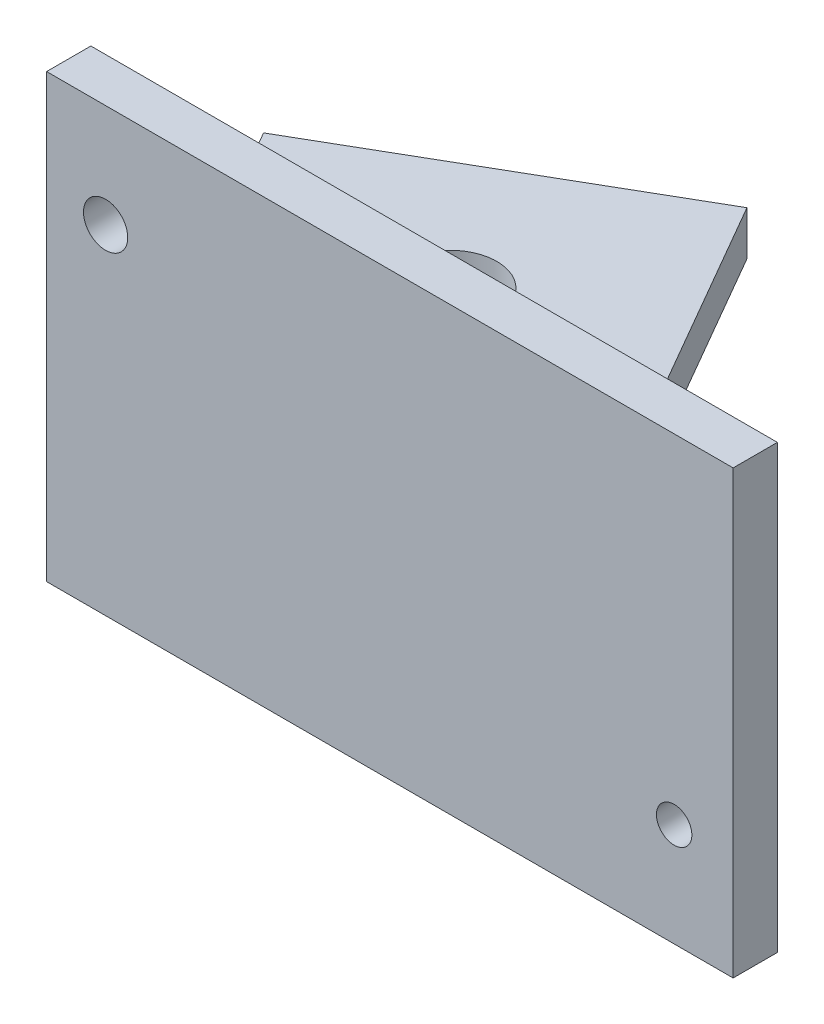
ISO-10303-21;
HEADER;
FILE_DESCRIPTION(('STEP AP214'),'2;1');
FILE_NAME('part.step','',(''),(''),'','','');
FILE_SCHEMA(('AUTOMOTIVE_DESIGN { 1 0 10303 214 1 1 1 1 }'));
ENDSEC;
DATA;
#1=APPLICATION_CONTEXT('core data for automotive mechanical design processes');
#2=APPLICATION_PROTOCOL_DEFINITION('international standard','automotive_design',2000,#1);
#3=PRODUCT_CONTEXT('',#1,'mechanical');
#4=PRODUCT('Part','Part','',(#3));
#5=PRODUCT_RELATED_PRODUCT_CATEGORY('part','',(#4));
#6=PRODUCT_DEFINITION_FORMATION('','',#4);
#7=PRODUCT_DEFINITION_CONTEXT('part definition',#1,'design');
#8=PRODUCT_DEFINITION('design','',#6,#7);
#9=PRODUCT_DEFINITION_SHAPE('','',#8);
#10=(LENGTH_UNIT() NAMED_UNIT(*) SI_UNIT(.MILLI.,.METRE.));
#11=(NAMED_UNIT(*) PLANE_ANGLE_UNIT() SI_UNIT($,.RADIAN.));
#12=(NAMED_UNIT(*) SI_UNIT($,.STERADIAN.) SOLID_ANGLE_UNIT());
#13=UNCERTAINTY_MEASURE_WITH_UNIT(LENGTH_MEASURE(1.E-05),#10,'distance_accuracy_value','');
#14=(GEOMETRIC_REPRESENTATION_CONTEXT(3) GLOBAL_UNCERTAINTY_ASSIGNED_CONTEXT((#13)) GLOBAL_UNIT_ASSIGNED_CONTEXT((#10,
#11,#12)) REPRESENTATION_CONTEXT('',''));
#15=CARTESIAN_POINT('',(0.,0.,0.));
#16=DIRECTION('',(0.,0.,1.));
#17=DIRECTION('',(1.,0.,0.));
#18=AXIS2_PLACEMENT_3D('',#15,#16,#17);
#19=CARTESIAN_POINT('',(0.,0.,2.38125));
#20=DIRECTION('',(0.,0.,-1.));
#21=DIRECTION('',(-1.,0.,0.));
#22=AXIS2_PLACEMENT_3D('',#19,#20,#21);
#23=PLANE('',#22);
#24=DIRECTION('',(0.,-1.,0.));
#25=VECTOR('',#24,1.);
#26=CARTESIAN_POINT('',(-1.5875,-1.5875,2.38125));
#27=LINE('',#26,#25);
#28=CARTESIAN_POINT('',(-1.5875,19.812,2.38125));
#29=VERTEX_POINT('',#28);
#30=CARTESIAN_POINT('',(-1.5875,-3.96875,2.38125));
#31=VERTEX_POINT('',#30);
#32=EDGE_CURVE('E157',#29,#31,#27,.T.);
#33=ORIENTED_EDGE('',*,*,#32,.T.);
#34=DIRECTION('',(-1.,0.,0.));
#35=VECTOR('',#34,1.);
#36=CARTESIAN_POINT('',(-1.5875,-3.96875,2.38125));
#37=LINE('',#36,#35);
#38=CARTESIAN_POINT('',(35.3695,-3.96875,2.38125));
#39=VERTEX_POINT('',#38);
#40=EDGE_CURVE('E121',#39,#31,#37,.T.);
#41=ORIENTED_EDGE('',*,*,#40,.F.);
#42=DIRECTION('',(0.,1.,0.));
#43=VECTOR('',#42,1.);
#44=CARTESIAN_POINT('',(35.3695,-1.5875,2.38125));
#45=LINE('',#44,#43);
#46=CARTESIAN_POINT('',(35.3695,19.812,2.38125));
#47=VERTEX_POINT('',#46);
#48=EDGE_CURVE('E160',#39,#47,#45,.T.);
#49=ORIENTED_EDGE('',*,*,#48,.T.);
#50=DIRECTION('',(-1.,0.,0.));
#51=VECTOR('',#50,1.);
#52=CARTESIAN_POINT('',(-1.5875,19.812,2.38125));
#53=LINE('',#52,#51);
#54=EDGE_CURVE('E164',#47,#29,#53,.T.);
#55=ORIENTED_EDGE('',*,*,#54,.T.);
#56=EDGE_LOOP('',(#33,#41,#49,#55));
#57=FACE_BOUND('',#56,.T.);
#58=CARTESIAN_POINT('',(1.5875,14.25575,2.38125));
#59=DIRECTION('',(0.,0.,1.));
#60=DIRECTION('',(1.,0.,0.));
#61=AXIS2_PLACEMENT_3D('',#58,#59,#60);
#62=CIRCLE('',#61,1.190625);
#63=CARTESIAN_POINT('',(2.778125,14.25575,2.38125));
#64=VERTEX_POINT('',#63);
#65=EDGE_CURVE('E151',#64,#64,#62,.T.);
#66=ORIENTED_EDGE('',*,*,#65,.F.);
#67=EDGE_LOOP('',(#66));
#68=FACE_BOUND('',#67,.T.);
#69=CARTESIAN_POINT('',(32.1945,1.5875,2.38125));
#70=DIRECTION('',(0.,0.,1.));
#71=DIRECTION('',(1.,0.,0.));
#72=AXIS2_PLACEMENT_3D('',#69,#70,#71);
#73=CIRCLE('',#72,0.952500000000004);
#74=CARTESIAN_POINT('',(33.147,1.5875,2.38125));
#75=VERTEX_POINT('',#74);
#76=EDGE_CURVE('E140',#75,#75,#73,.T.);
#77=ORIENTED_EDGE('',*,*,#76,.F.);
#78=EDGE_LOOP('',(#77));
#79=FACE_BOUND('',#78,.T.);
#80=ADVANCED_FACE('F39',(#57,#68,#79),#23,.F.);
#81=CARTESIAN_POINT('',(0.,0.,0.));
#82=DIRECTION('',(0.,0.,-1.));
#83=DIRECTION('',(-1.,0.,0.));
#84=AXIS2_PLACEMENT_3D('',#81,#82,#83);
#85=PLANE('',#84);
#86=CARTESIAN_POINT('',(1.5875,14.25575,0.));
#87=DIRECTION('',(0.,0.,1.));
#88=DIRECTION('',(1.,0.,0.));
#89=AXIS2_PLACEMENT_3D('',#86,#87,#88);
#90=CIRCLE('',#89,1.190625);
#91=CARTESIAN_POINT('',(2.778125,14.25575,0.));
#92=VERTEX_POINT('',#91);
#93=EDGE_CURVE('E149',#92,#92,#90,.T.);
#94=ORIENTED_EDGE('',*,*,#93,.T.);
#95=EDGE_LOOP('',(#94));
#96=FACE_BOUND('',#95,.T.);
#97=DIRECTION('',(0.,1.,0.));
#98=VECTOR('',#97,1.);
#99=CARTESIAN_POINT('',(20.4095452561247,-3.96875,0.));
#100=LINE('',#99,#98);
#101=CARTESIAN_POINT('',(20.4095452561247,-3.96875,0.));
#102=VERTEX_POINT('',#101);
#103=CARTESIAN_POINT('',(20.4095452561247,0.9525,0.));
#104=VERTEX_POINT('',#103);
#105=EDGE_CURVE('E54',#102,#104,#100,.T.);
#106=ORIENTED_EDGE('',*,*,#105,.T.);
#107=DIRECTION('',(1.,0.,0.));
#108=VECTOR('',#107,1.);
#109=CARTESIAN_POINT('',(0.,0.9525,0.));
#110=LINE('',#109,#108);
#111=CARTESIAN_POINT('',(-1.5875,0.952499999999997,0.));
#112=VERTEX_POINT('',#111);
#113=EDGE_CURVE('E183',#104,#112,#110,.F.);
#114=ORIENTED_EDGE('',*,*,#113,.T.);
#115=DIRECTION('',(0.,-1.,0.));
#116=VECTOR('',#115,1.);
#117=CARTESIAN_POINT('',(-1.5875,-1.5875,0.));
#118=LINE('',#117,#116);
#119=CARTESIAN_POINT('',(-1.5875,19.812,0.));
#120=VERTEX_POINT('',#119);
#121=EDGE_CURVE('E131',#120,#112,#118,.T.);
#122=ORIENTED_EDGE('',*,*,#121,.F.);
#123=DIRECTION('',(-1.,0.,0.));
#124=VECTOR('',#123,1.);
#125=CARTESIAN_POINT('',(-1.5875,19.812,0.));
#126=LINE('',#125,#124);
#127=CARTESIAN_POINT('',(35.3695,19.812,0.));
#128=VERTEX_POINT('',#127);
#129=EDGE_CURVE('E161',#128,#120,#126,.T.);
#130=ORIENTED_EDGE('',*,*,#129,.F.);
#131=DIRECTION('',(0.,1.,0.));
#132=VECTOR('',#131,1.);
#133=CARTESIAN_POINT('',(35.3695,-1.5875,0.));
#134=LINE('',#133,#132);
#135=CARTESIAN_POINT('',(35.3695,-3.96875,0.));
#136=VERTEX_POINT('',#135);
#137=EDGE_CURVE('E170',#136,#128,#134,.T.);
#138=ORIENTED_EDGE('',*,*,#137,.F.);
#139=DIRECTION('',(1.,0.,0.));
#140=VECTOR('',#139,1.);
#141=CARTESIAN_POINT('',(20.4095452561247,-3.96875,0.));
#142=LINE('',#141,#140);
#143=EDGE_CURVE('E209',#102,#136,#142,.T.);
#144=ORIENTED_EDGE('',*,*,#143,.F.);
#145=EDGE_LOOP('',(#106,#114,#122,#130,#138,#144));
#146=FACE_BOUND('',#145,.T.);
#147=CARTESIAN_POINT('',(32.1945,1.5875,0.));
#148=DIRECTION('',(0.,0.,1.));
#149=DIRECTION('',(1.,0.,0.));
#150=AXIS2_PLACEMENT_3D('',#147,#148,#149);
#151=CIRCLE('',#150,0.952500000000004);
#152=CARTESIAN_POINT('',(33.147,1.5875,0.));
#153=VERTEX_POINT('',#152);
#154=EDGE_CURVE('E134',#153,#153,#151,.T.);
#155=ORIENTED_EDGE('',*,*,#154,.T.);
#156=EDGE_LOOP('',(#155));
#157=FACE_BOUND('',#156,.T.);
#158=ADVANCED_FACE('F193',(#96,#146,#157),#85,.T.);
#159=CARTESIAN_POINT('',(-1.5875,-1.5875,2.38125));
#160=DIRECTION('',(1.,0.,0.));
#161=DIRECTION('',(0.,0.,-1.));
#162=AXIS2_PLACEMENT_3D('',#159,#160,#161);
#163=PLANE('',#162);
#164=ORIENTED_EDGE('',*,*,#121,.T.);
#165=DIRECTION('',(0.,1.,0.));
#166=VECTOR('',#165,1.);
#167=CARTESIAN_POINT('',(-1.5875,-3.96875,0.));
#168=LINE('',#167,#166);
#169=CARTESIAN_POINT('',(-1.5875,-3.96875,0.));
#170=VERTEX_POINT('',#169);
#171=EDGE_CURVE('E107',#170,#112,#168,.T.);
#172=ORIENTED_EDGE('',*,*,#171,.F.);
#173=DIRECTION('',(0.,0.,-1.));
#174=VECTOR('',#173,1.);
#175=CARTESIAN_POINT('',(-1.5875,-3.96875,2.38125));
#176=LINE('',#175,#174);
#177=EDGE_CURVE('E114',#31,#170,#176,.T.);
#178=ORIENTED_EDGE('',*,*,#177,.F.);
#179=ORIENTED_EDGE('',*,*,#32,.F.);
#180=DIRECTION('',(0.,0.,-1.));
#181=VECTOR('',#180,1.);
#182=CARTESIAN_POINT('',(-1.5875,19.812,2.38125));
#183=LINE('',#182,#181);
#184=EDGE_CURVE('E167',#29,#120,#183,.T.);
#185=ORIENTED_EDGE('',*,*,#184,.T.);
#186=EDGE_LOOP('',(#164,#172,#178,#179,#185));
#187=FACE_BOUND('',#186,.T.);
#188=ADVANCED_FACE('F128',(#187),#163,.F.);
#189=CARTESIAN_POINT('',(35.3695,-1.5875,2.38125));
#190=DIRECTION('',(-1.,0.,0.));
#191=DIRECTION('',(0.,0.,1.));
#192=AXIS2_PLACEMENT_3D('',#189,#190,#191);
#193=PLANE('',#192);
#194=ORIENTED_EDGE('',*,*,#137,.T.);
#195=DIRECTION('',(0.,0.,-1.));
#196=VECTOR('',#195,1.);
#197=CARTESIAN_POINT('',(35.3695,19.812,2.38125));
#198=LINE('',#197,#196);
#199=EDGE_CURVE('E176',#47,#128,#198,.T.);
#200=ORIENTED_EDGE('',*,*,#199,.F.);
#201=ORIENTED_EDGE('',*,*,#48,.F.);
#202=DIRECTION('',(0.,0.,1.));
#203=VECTOR('',#202,1.);
#204=CARTESIAN_POINT('',(35.3695,-3.96875,2.38125));
#205=LINE('',#204,#203);
#206=EDGE_CURVE('E207',#136,#39,#205,.T.);
#207=ORIENTED_EDGE('',*,*,#206,.F.);
#208=EDGE_LOOP('',(#194,#200,#201,#207));
#209=FACE_BOUND('',#208,.T.);
#210=ADVANCED_FACE('F206',(#209),#193,.F.);
#211=CARTESIAN_POINT('',(-1.5875,19.812,2.38125));
#212=DIRECTION('',(0.,-1.,0.));
#213=DIRECTION('',(0.,0.,-1.));
#214=AXIS2_PLACEMENT_3D('',#211,#212,#213);
#215=PLANE('',#214);
#216=ORIENTED_EDGE('',*,*,#129,.T.);
#217=ORIENTED_EDGE('',*,*,#184,.F.);
#218=ORIENTED_EDGE('',*,*,#54,.F.);
#219=ORIENTED_EDGE('',*,*,#199,.T.);
#220=EDGE_LOOP('',(#216,#217,#218,#219));
#221=FACE_BOUND('',#220,.T.);
#222=ADVANCED_FACE('F199',(#221),#215,.F.);
#223=CARTESIAN_POINT('',(1.5875,14.25575,2.38125));
#224=DIRECTION('',(0.,0.,-1.));
#225=DIRECTION('',(-1.,0.,0.));
#226=AXIS2_PLACEMENT_3D('',#223,#224,#225);
#227=CYLINDRICAL_SURFACE('',#226,1.190625);
#228=ORIENTED_EDGE('',*,*,#65,.T.);
#229=EDGE_LOOP('',(#228));
#230=FACE_BOUND('',#229,.T.);
#231=ORIENTED_EDGE('',*,*,#93,.F.);
#232=EDGE_LOOP('',(#231));
#233=FACE_BOUND('',#232,.T.);
#234=ADVANCED_FACE('F286',(#230,#233),#227,.F.);
#235=CARTESIAN_POINT('',(32.1945,1.5875,2.38125));
#236=DIRECTION('',(0.,0.,-1.));
#237=DIRECTION('',(-1.,0.,0.));
#238=AXIS2_PLACEMENT_3D('',#235,#236,#237);
#239=CYLINDRICAL_SURFACE('',#238,0.952500000000004);
#240=ORIENTED_EDGE('',*,*,#76,.T.);
#241=EDGE_LOOP('',(#240));
#242=FACE_BOUND('',#241,.T.);
#243=ORIENTED_EDGE('',*,*,#154,.F.);
#244=EDGE_LOOP('',(#243));
#245=FACE_BOUND('',#244,.T.);
#246=ADVANCED_FACE('F260',(#242,#245),#239,.F.);
#247=CARTESIAN_POINT('',(0.,-1.5875,0.));
#248=DIRECTION('',(0.,-1.,0.));
#249=DIRECTION('',(0.,0.,-1.));
#250=AXIS2_PLACEMENT_3D('',#247,#248,#249);
#251=PLANE('',#250);
#252=CARTESIAN_POINT('',(-2.01897737193758,-1.5875,-19.7973407305123));
#253=DIRECTION('',(0.,1.,0.));
#254=DIRECTION('',(0.,0.,1.));
#255=AXIS2_PLACEMENT_3D('',#252,#253,#254);
#256=CIRCLE('',#255,2.48919999999999);
#257=CARTESIAN_POINT('',(-2.01897737193758,-1.5875,-17.3081407305123));
#258=VERTEX_POINT('',#257);
#259=EDGE_CURVE('E223',#258,#258,#256,.T.);
#260=ORIENTED_EDGE('',*,*,#259,.F.);
#261=EDGE_LOOP('',(#260));
#262=FACE_BOUND('',#261,.T.);
#263=CARTESIAN_POINT('',(4.33102262806239,-1.5875,-8.79881810244991));
#264=DIRECTION('',(0.,1.,0.));
#265=DIRECTION('',(0.,0.,1.));
#266=AXIS2_PLACEMENT_3D('',#263,#264,#265);
#267=CIRCLE('',#266,2.4892);
#268=CARTESIAN_POINT('',(4.33102262806239,-1.5875,-6.30961810244992));
#269=VERTEX_POINT('',#268);
#270=EDGE_CURVE('E244',#269,#269,#267,.T.);
#271=ORIENTED_EDGE('',*,*,#270,.F.);
#272=EDGE_LOOP('',(#271));
#273=FACE_BOUND('',#272,.T.);
#274=DIRECTION('',(-0.499999999999997,0.,-0.86602540378444));
#275=VECTOR('',#274,1.);
#276=CARTESIAN_POINT('',(-1.5875,-1.5875,0.));
#277=LINE('',#276,#275);
#278=CARTESIAN_POINT('',(-3.05396968374164,-1.5875,-2.54));
#279=VERTEX_POINT('',#278);
#280=CARTESIAN_POINT('',(-14.2874999999999,-1.5875,-21.9970452561248));
#281=VERTEX_POINT('',#280);
#282=EDGE_CURVE('E219',#279,#281,#277,.T.);
#283=ORIENTED_EDGE('',*,*,#282,.F.);
#284=DIRECTION('',(1.,0.,0.));
#285=VECTOR('',#284,1.);
#286=CARTESIAN_POINT('',(0.,-1.5875,-2.54));
#287=LINE('',#286,#285);
#288=CARTESIAN_POINT('',(18.9430755723831,-1.5875,-2.54));
#289=VERTEX_POINT('',#288);
#290=EDGE_CURVE('E180',#279,#289,#287,.T.);
#291=ORIENTED_EDGE('',*,*,#290,.T.);
#292=DIRECTION('',(0.499999999999998,0.,0.86602540378444));
#293=VECTOR('',#292,1.);
#294=CARTESIAN_POINT('',(2.21028394209365,-1.5875,-31.5220452561247));
#295=LINE('',#294,#293);
#296=CARTESIAN_POINT('',(2.21028394209365,-1.5875,-31.5220452561247));
#297=VERTEX_POINT('',#296);
#298=EDGE_CURVE('E125',#297,#289,#295,.T.);
#299=ORIENTED_EDGE('',*,*,#298,.F.);
#300=DIRECTION('',(0.86602540378444,0.,-0.499999999999998));
#301=VECTOR('',#300,1.);
#302=CARTESIAN_POINT('',(2.21028394209365,-1.5875,-31.5220452561247));
#303=LINE('',#302,#301);
#304=EDGE_CURVE('E222',#281,#297,#303,.T.);
#305=ORIENTED_EDGE('',*,*,#304,.F.);
#306=EDGE_LOOP('',(#283,#291,#299,#305));
#307=FACE_BOUND('',#306,.T.);
#308=ADVANCED_FACE('F235',(#262,#273,#307),#251,.F.);
#309=CARTESIAN_POINT('',(-1.5875,-3.96875,0.));
#310=DIRECTION('',(0.86602540378444,0.,-0.499999999999997));
#311=DIRECTION('',(-0.499999999999997,0.,-0.86602540378444));
#312=AXIS2_PLACEMENT_3D('',#309,#310,#311);
#313=PLANE('',#312);
#314=ORIENTED_EDGE('',*,*,#171,.T.);
#315=CARTESIAN_POINT('',(-3.05396968374164,0.9525,-2.54));
#316=DIRECTION('',(0.86602540378444,0.,-0.499999999999997));
#317=DIRECTION('',(0.499999999999997,0.,0.86602540378444));
#318=AXIS2_PLACEMENT_3D('',#315,#316,#317);
#319=ELLIPSE('',#318,2.93293936748329,2.54);
#320=EDGE_CURVE('E11',#112,#279,#319,.T.);
#321=ORIENTED_EDGE('',*,*,#320,.T.);
#322=ORIENTED_EDGE('',*,*,#282,.T.);
#323=DIRECTION('',(0.,1.,0.));
#324=VECTOR('',#323,1.);
#325=CARTESIAN_POINT('',(-14.2874999999999,-3.96875,-21.9970452561248));
#326=LINE('',#325,#324);
#327=CARTESIAN_POINT('',(-14.2874999999999,-3.96875,-21.9970452561248));
#328=VERTEX_POINT('',#327);
#329=EDGE_CURVE('E109',#328,#281,#326,.T.);
#330=ORIENTED_EDGE('',*,*,#329,.F.);
#331=DIRECTION('',(-0.499999999999997,0.,-0.86602540378444));
#332=VECTOR('',#331,1.);
#333=CARTESIAN_POINT('',(-1.5875,-3.96875,0.));
#334=LINE('',#333,#332);
#335=EDGE_CURVE('E103',#170,#328,#334,.T.);
#336=ORIENTED_EDGE('',*,*,#335,.F.);
#337=EDGE_LOOP('',(#314,#321,#322,#330,#336));
#338=FACE_BOUND('',#337,.T.);
#339=ADVANCED_FACE('F105',(#338),#313,.F.);
#340=CARTESIAN_POINT('',(2.21028394209365,-3.96875,-31.5220452561247));
#341=DIRECTION('',(0.499999999999998,0.,0.86602540378444));
#342=DIRECTION('',(0.86602540378444,0.,-0.499999999999998));
#343=AXIS2_PLACEMENT_3D('',#340,#341,#342);
#344=PLANE('',#343);
#345=ORIENTED_EDGE('',*,*,#304,.T.);
#346=DIRECTION('',(0.,1.,0.));
#347=VECTOR('',#346,1.);
#348=CARTESIAN_POINT('',(2.21028394209365,-3.96875,-31.5220452561247));
#349=LINE('',#348,#347);
#350=CARTESIAN_POINT('',(2.21028394209365,-3.96875,-31.5220452561247));
#351=VERTEX_POINT('',#350);
#352=EDGE_CURVE('E143',#351,#297,#349,.T.);
#353=ORIENTED_EDGE('',*,*,#352,.F.);
#354=DIRECTION('',(0.86602540378444,0.,-0.499999999999998));
#355=VECTOR('',#354,1.);
#356=CARTESIAN_POINT('',(2.21028394209365,-3.96875,-31.5220452561247));
#357=LINE('',#356,#355);
#358=EDGE_CURVE('E113',#328,#351,#357,.T.);
#359=ORIENTED_EDGE('',*,*,#358,.F.);
#360=ORIENTED_EDGE('',*,*,#329,.T.);
#361=EDGE_LOOP('',(#345,#353,#359,#360));
#362=FACE_BOUND('',#361,.T.);
#363=ADVANCED_FACE('F236',(#362),#344,.F.);
#364=CARTESIAN_POINT('',(2.21028394209365,-3.96875,-31.5220452561247));
#365=DIRECTION('',(-0.86602540378444,0.,0.499999999999998));
#366=DIRECTION('',(0.499999999999998,0.,0.86602540378444));
#367=AXIS2_PLACEMENT_3D('',#364,#365,#366);
#368=PLANE('',#367);
#369=ORIENTED_EDGE('',*,*,#298,.T.);
#370=CARTESIAN_POINT('',(18.9430755723831,0.9525,-2.54));
#371=DIRECTION('',(-0.86602540378444,0.,0.499999999999998));
#372=DIRECTION('',(0.499999999999998,0.,0.86602540378444));
#373=AXIS2_PLACEMENT_3D('',#370,#371,#372);
#374=ELLIPSE('',#373,2.93293936748329,2.54);
#375=EDGE_CURVE('E48',#289,#104,#374,.T.);
#376=ORIENTED_EDGE('',*,*,#375,.T.);
#377=ORIENTED_EDGE('',*,*,#105,.F.);
#378=DIRECTION('',(0.499999999999998,0.,0.86602540378444));
#379=VECTOR('',#378,1.);
#380=CARTESIAN_POINT('',(2.21028394209365,-3.96875,-31.5220452561247));
#381=LINE('',#380,#379);
#382=EDGE_CURVE('E215',#351,#102,#381,.T.);
#383=ORIENTED_EDGE('',*,*,#382,.F.);
#384=ORIENTED_EDGE('',*,*,#352,.T.);
#385=EDGE_LOOP('',(#369,#376,#377,#383,#384));
#386=FACE_BOUND('',#385,.T.);
#387=ADVANCED_FACE('F187',(#386),#368,.F.);
#388=CARTESIAN_POINT('',(0.,-3.96875,0.));
#389=DIRECTION('',(0.,-1.,0.));
#390=DIRECTION('',(0.,0.,-1.));
#391=AXIS2_PLACEMENT_3D('',#388,#389,#390);
#392=PLANE('',#391);
#393=CARTESIAN_POINT('',(-2.01897737193758,-3.96875,-19.7973407305123));
#394=DIRECTION('',(0.,-1.,0.));
#395=DIRECTION('',(0.,0.,-1.));
#396=AXIS2_PLACEMENT_3D('',#393,#394,#395);
#397=CIRCLE('',#396,2.48919999999999);
#398=CARTESIAN_POINT('',(-2.01897737193758,-3.96875,-22.2865407305123));
#399=VERTEX_POINT('',#398);
#400=EDGE_CURVE('E248',#399,#399,#397,.F.);
#401=ORIENTED_EDGE('',*,*,#400,.T.);
#402=EDGE_LOOP('',(#401));
#403=FACE_BOUND('',#402,.T.);
#404=CARTESIAN_POINT('',(4.33102262806239,-3.96875,-8.79881810244991));
#405=DIRECTION('',(0.,-1.,0.));
#406=DIRECTION('',(0.,0.,-1.));
#407=AXIS2_PLACEMENT_3D('',#404,#405,#406);
#408=CIRCLE('',#407,2.4892);
#409=CARTESIAN_POINT('',(4.33102262806239,-3.96875,-11.2880181024499));
#410=VERTEX_POINT('',#409);
#411=EDGE_CURVE('E241',#410,#410,#408,.F.);
#412=ORIENTED_EDGE('',*,*,#411,.T.);
#413=EDGE_LOOP('',(#412));
#414=FACE_BOUND('',#413,.T.);
#415=ORIENTED_EDGE('',*,*,#177,.T.);
#416=ORIENTED_EDGE('',*,*,#335,.T.);
#417=ORIENTED_EDGE('',*,*,#358,.T.);
#418=ORIENTED_EDGE('',*,*,#382,.T.);
#419=ORIENTED_EDGE('',*,*,#143,.T.);
#420=ORIENTED_EDGE('',*,*,#206,.T.);
#421=ORIENTED_EDGE('',*,*,#40,.T.);
#422=EDGE_LOOP('',(#415,#416,#417,#418,#419,#420,#421));
#423=FACE_BOUND('',#422,.T.);
#424=ADVANCED_FACE('F118',(#403,#414,#423),#392,.T.);
#425=CARTESIAN_POINT('',(4.33102262806239,-3.96975,-8.79881810244991));
#426=DIRECTION('',(0.,1.,0.));
#427=DIRECTION('',(0.,0.,1.));
#428=AXIS2_PLACEMENT_3D('',#425,#426,#427);
#429=CYLINDRICAL_SURFACE('',#428,2.4892);
#430=ORIENTED_EDGE('',*,*,#411,.F.);
#431=EDGE_LOOP('',(#430));
#432=FACE_BOUND('',#431,.T.);
#433=ORIENTED_EDGE('',*,*,#270,.T.);
#434=EDGE_LOOP('',(#433));
#435=FACE_BOUND('',#434,.T.);
#436=ADVANCED_FACE('F264',(#432,#435),#429,.F.);
#437=CARTESIAN_POINT('',(-2.01897737193758,-3.96975,-19.7973407305123));
#438=DIRECTION('',(0.,1.,0.));
#439=DIRECTION('',(0.,0.,1.));
#440=AXIS2_PLACEMENT_3D('',#437,#438,#439);
#441=CYLINDRICAL_SURFACE('',#440,2.48919999999999);
#442=ORIENTED_EDGE('',*,*,#400,.F.);
#443=EDGE_LOOP('',(#442));
#444=FACE_BOUND('',#443,.T.);
#445=ORIENTED_EDGE('',*,*,#259,.T.);
#446=EDGE_LOOP('',(#445));
#447=FACE_BOUND('',#446,.T.);
#448=ADVANCED_FACE('F256',(#444,#447),#441,.F.);
#449=CARTESIAN_POINT('',(0.,0.9525,-2.54));
#450=DIRECTION('',(1.,0.,0.));
#451=DIRECTION('',(0.,0.,-1.));
#452=AXIS2_PLACEMENT_3D('',#449,#450,#451);
#453=CYLINDRICAL_SURFACE('',#452,2.54);
#454=ORIENTED_EDGE('',*,*,#320,.F.);
#455=ORIENTED_EDGE('',*,*,#113,.F.);
#456=ORIENTED_EDGE('',*,*,#375,.F.);
#457=ORIENTED_EDGE('',*,*,#290,.F.);
#458=EDGE_LOOP('',(#454,#455,#456,#457));
#459=FACE_BOUND('',#458,.T.);
#460=ADVANCED_FACE('F41',(#459),#453,.F.);
#461=CLOSED_SHELL('',(#80,#158,#188,#210,#222,#234,#246,#308,#339,#363,#387,#424,#436,#448,#460));
#462=MANIFOLD_SOLID_BREP('B2',#461);
#463=ADVANCED_BREP_SHAPE_REPRESENTATION('',(#18,#462),#14);
#464=SHAPE_DEFINITION_REPRESENTATION(#9,#463);
ENDSEC;
END-ISO-10303-21;
